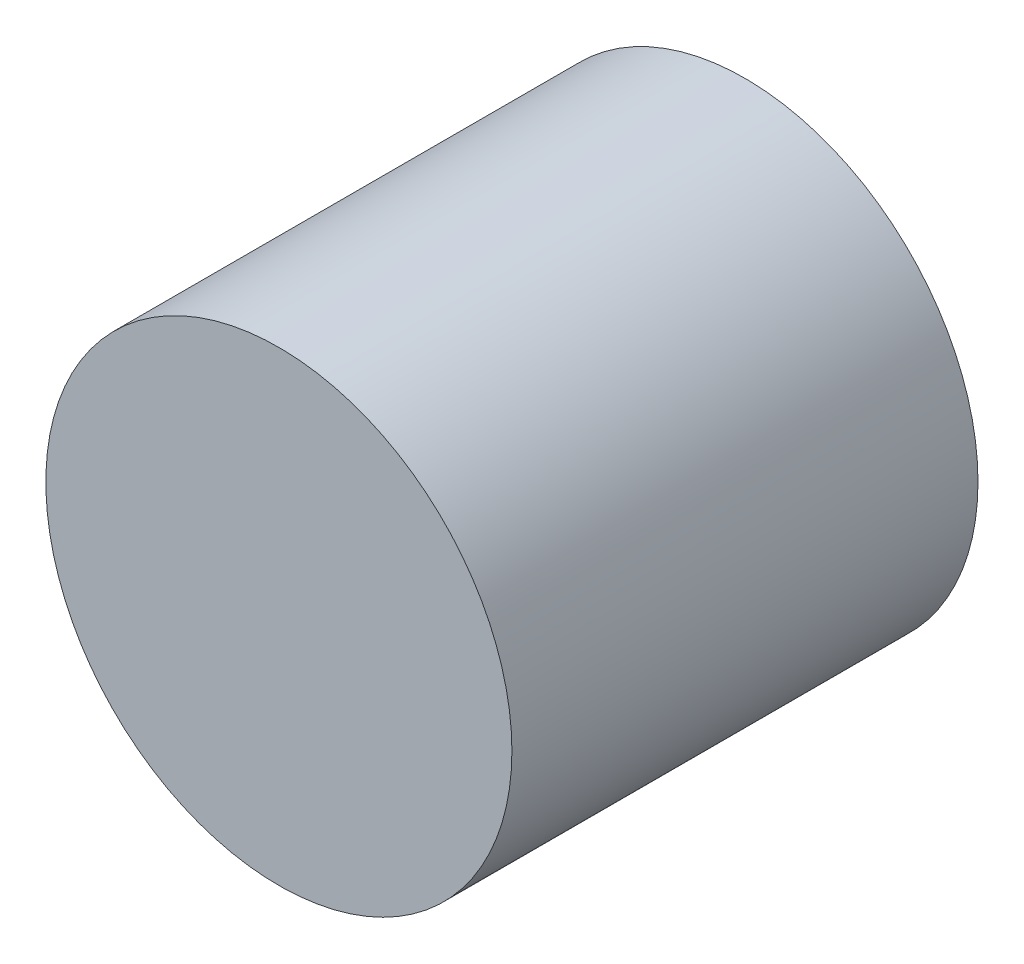
ISO-10303-21;
HEADER;
FILE_DESCRIPTION(('STEP AP214'),'2;1');
FILE_NAME('part.step','',(''),(''),'','','');
FILE_SCHEMA(('AUTOMOTIVE_DESIGN { 1 0 10303 214 1 1 1 1 }'));
ENDSEC;
DATA;
#1=APPLICATION_CONTEXT('core data for automotive mechanical design processes');
#2=APPLICATION_PROTOCOL_DEFINITION('international standard','automotive_design',2000,#1);
#3=PRODUCT_CONTEXT('',#1,'mechanical');
#4=PRODUCT('Part','Part','',(#3));
#5=PRODUCT_RELATED_PRODUCT_CATEGORY('part','',(#4));
#6=PRODUCT_DEFINITION_FORMATION('','',#4);
#7=PRODUCT_DEFINITION_CONTEXT('part definition',#1,'design');
#8=PRODUCT_DEFINITION('design','',#6,#7);
#9=PRODUCT_DEFINITION_SHAPE('','',#8);
#10=(LENGTH_UNIT() NAMED_UNIT(*) SI_UNIT(.MILLI.,.METRE.));
#11=(NAMED_UNIT(*) PLANE_ANGLE_UNIT() SI_UNIT($,.RADIAN.));
#12=(NAMED_UNIT(*) SI_UNIT($,.STERADIAN.) SOLID_ANGLE_UNIT());
#13=UNCERTAINTY_MEASURE_WITH_UNIT(LENGTH_MEASURE(1.E-05),#10,'distance_accuracy_value','');
#14=(GEOMETRIC_REPRESENTATION_CONTEXT(3) GLOBAL_UNCERTAINTY_ASSIGNED_CONTEXT((#13)) GLOBAL_UNIT_ASSIGNED_CONTEXT((#10,
#11,#12)) REPRESENTATION_CONTEXT('',''));
#15=CARTESIAN_POINT('',(0.,0.,0.));
#16=DIRECTION('',(0.,0.,1.));
#17=DIRECTION('',(1.,0.,0.));
#18=AXIS2_PLACEMENT_3D('',#15,#16,#17);
#19=CARTESIAN_POINT('',(0.,0.,50.8));
#20=DIRECTION('',(0.,0.,-1.));
#21=DIRECTION('',(-1.,0.,0.));
#22=AXIS2_PLACEMENT_3D('',#19,#20,#21);
#23=CYLINDRICAL_SURFACE('',#22,25.4);
#24=CARTESIAN_POINT('',(0.,0.,50.8));
#25=DIRECTION('',(0.,0.,1.));
#26=DIRECTION('',(1.,0.,0.));
#27=AXIS2_PLACEMENT_3D('',#24,#25,#26);
#28=CIRCLE('',#27,25.4);
#29=CARTESIAN_POINT('',(25.4,0.,50.8));
#30=VERTEX_POINT('',#29);
#31=EDGE_CURVE('E10',#30,#30,#28,.T.);
#32=ORIENTED_EDGE('',*,*,#31,.F.);
#33=EDGE_LOOP('',(#32));
#34=FACE_BOUND('',#33,.T.);
#35=CARTESIAN_POINT('',(0.,0.,0.));
#36=DIRECTION('',(0.,0.,1.));
#37=DIRECTION('',(1.,0.,0.));
#38=AXIS2_PLACEMENT_3D('',#35,#36,#37);
#39=CIRCLE('',#38,25.4);
#40=CARTESIAN_POINT('',(25.4,0.,0.));
#41=VERTEX_POINT('',#40);
#42=EDGE_CURVE('E40',#41,#41,#39,.T.);
#43=ORIENTED_EDGE('',*,*,#42,.T.);
#44=EDGE_LOOP('',(#43));
#45=FACE_BOUND('',#44,.T.);
#46=ADVANCED_FACE('F37',(#34,#45),#23,.T.);
#47=CARTESIAN_POINT('',(0.,0.,50.8));
#48=DIRECTION('',(0.,0.,1.));
#49=DIRECTION('',(1.,0.,0.));
#50=AXIS2_PLACEMENT_3D('',#47,#48,#49);
#51=PLANE('',#50);
#52=ORIENTED_EDGE('',*,*,#31,.T.);
#53=EDGE_LOOP('',(#52));
#54=FACE_BOUND('',#53,.T.);
#55=ADVANCED_FACE('F54',(#54),#51,.T.);
#56=CARTESIAN_POINT('',(0.,0.,0.));
#57=DIRECTION('',(0.,0.,1.));
#58=DIRECTION('',(1.,0.,0.));
#59=AXIS2_PLACEMENT_3D('',#56,#57,#58);
#60=PLANE('',#59);
#61=ORIENTED_EDGE('',*,*,#42,.F.);
#62=EDGE_LOOP('',(#61));
#63=FACE_BOUND('',#62,.T.);
#64=ADVANCED_FACE('F52',(#63),#60,.F.);
#65=CLOSED_SHELL('',(#46,#55,#64));
#66=MANIFOLD_SOLID_BREP('B2',#65);
#67=ADVANCED_BREP_SHAPE_REPRESENTATION('',(#18,#66),#14);
#68=SHAPE_DEFINITION_REPRESENTATION(#9,#67);
ENDSEC;
END-ISO-10303-21;
